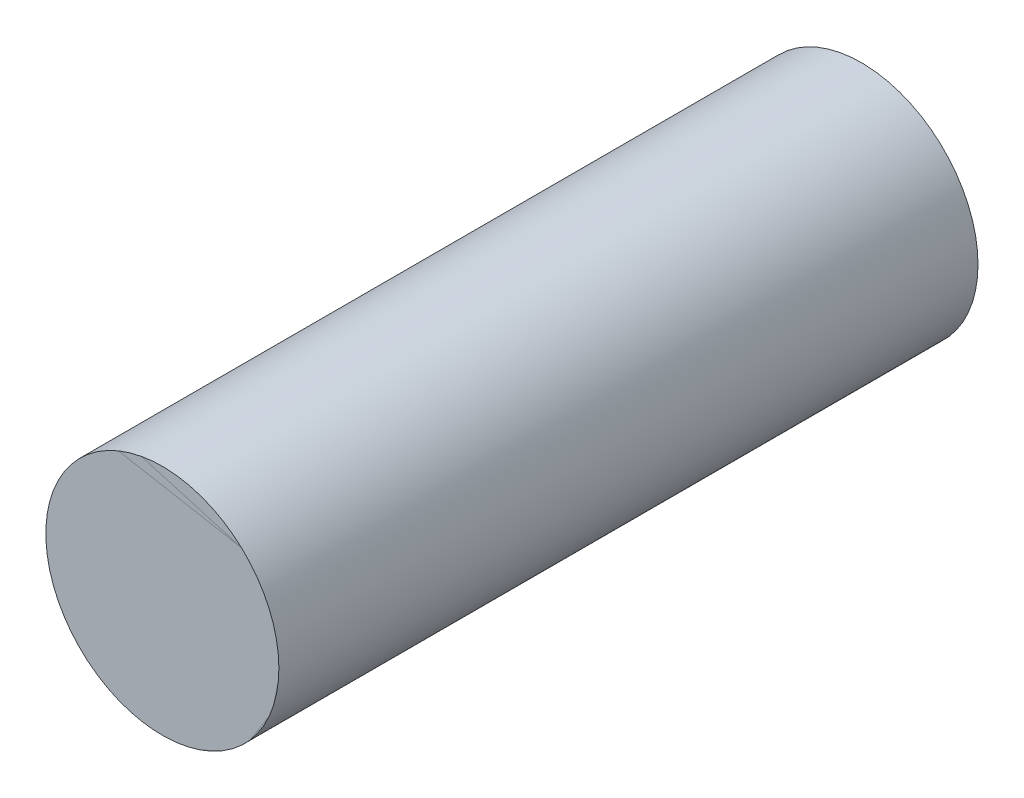
ISO-10303-21;
HEADER;
FILE_DESCRIPTION(('STEP AP214'),'2;1');
FILE_NAME('part.step','',(''),(''),'','','');
FILE_SCHEMA(('AUTOMOTIVE_DESIGN { 1 0 10303 214 1 1 1 1 }'));
ENDSEC;
DATA;
#1=APPLICATION_CONTEXT('core data for automotive mechanical design processes');
#2=APPLICATION_PROTOCOL_DEFINITION('international standard','automotive_design',2000,#1);
#3=PRODUCT_CONTEXT('',#1,'mechanical');
#4=PRODUCT('Part','Part','',(#3));
#5=PRODUCT_RELATED_PRODUCT_CATEGORY('part','',(#4));
#6=PRODUCT_DEFINITION_FORMATION('','',#4);
#7=PRODUCT_DEFINITION_CONTEXT('part definition',#1,'design');
#8=PRODUCT_DEFINITION('design','',#6,#7);
#9=PRODUCT_DEFINITION_SHAPE('','',#8);
#10=(LENGTH_UNIT() NAMED_UNIT(*) SI_UNIT(.MILLI.,.METRE.));
#11=(NAMED_UNIT(*) PLANE_ANGLE_UNIT() SI_UNIT($,.RADIAN.));
#12=(NAMED_UNIT(*) SI_UNIT($,.STERADIAN.) SOLID_ANGLE_UNIT());
#13=UNCERTAINTY_MEASURE_WITH_UNIT(LENGTH_MEASURE(1.E-05),#10,'distance_accuracy_value','');
#14=(GEOMETRIC_REPRESENTATION_CONTEXT(3) GLOBAL_UNCERTAINTY_ASSIGNED_CONTEXT((#13)) GLOBAL_UNIT_ASSIGNED_CONTEXT((#10,
#11,#12)) REPRESENTATION_CONTEXT('',''));
#15=CARTESIAN_POINT('',(0.,0.,0.));
#16=DIRECTION('',(0.,0.,1.));
#17=DIRECTION('',(1.,0.,0.));
#18=AXIS2_PLACEMENT_3D('',#15,#16,#17);
#19=CARTESIAN_POINT('',(-127.923352159799,-36.0039777719793,-7.54999999999981));
#20=DIRECTION('',(0.,0.,1.));
#21=DIRECTION('',(1.,0.,0.));
#22=AXIS2_PLACEMENT_3D('',#19,#20,#21);
#23=CYLINDRICAL_SURFACE('',#22,0.299999999999984);
#24=CARTESIAN_POINT('',(-127.923352159799,-36.0039777719793,-7.54999999999981));
#25=DIRECTION('',(0.,0.,1.));
#26=DIRECTION('',(1.,0.,0.));
#27=AXIS2_PLACEMENT_3D('',#24,#25,#26);
#28=CIRCLE('',#27,0.299999999999984);
#29=CARTESIAN_POINT('',(-127.623352159799,-36.0039777719793,-7.54999999999981));
#30=VERTEX_POINT('',#29);
#31=EDGE_CURVE('E11',#30,#30,#28,.T.);
#32=ORIENTED_EDGE('',*,*,#31,.T.);
#33=EDGE_LOOP('',(#32));
#34=FACE_BOUND('',#33,.T.);
#35=CARTESIAN_POINT('',(-127.923352159799,-36.0039777719793,-5.74999999999981));
#36=DIRECTION('',(0.,0.,1.));
#37=DIRECTION('',(1.,0.,0.));
#38=AXIS2_PLACEMENT_3D('',#35,#36,#37);
#39=CIRCLE('',#38,0.299999999999984);
#40=CARTESIAN_POINT('',(-127.623352159799,-36.0039777719793,-5.74999999999981));
#41=VERTEX_POINT('',#40);
#42=EDGE_CURVE('E46',#41,#41,#39,.T.);
#43=ORIENTED_EDGE('',*,*,#42,.F.);
#44=EDGE_LOOP('',(#43));
#45=FACE_BOUND('',#44,.T.);
#46=ADVANCED_FACE('F43',(#34,#45),#23,.T.);
#47=CARTESIAN_POINT('',(-127.923352159799,-36.0039777719793,-7.54999999999981));
#48=DIRECTION('',(0.,0.,1.));
#49=DIRECTION('',(1.,0.,0.));
#50=AXIS2_PLACEMENT_3D('',#47,#48,#49);
#51=PLANE('',#50);
#52=ORIENTED_EDGE('',*,*,#31,.F.);
#53=EDGE_LOOP('',(#52));
#54=FACE_BOUND('',#53,.T.);
#55=ADVANCED_FACE('F58',(#54),#51,.F.);
#56=CARTESIAN_POINT('',(-127.923352159799,-36.0039777719793,-5.74999999999981));
#57=DIRECTION('',(0.,0.,1.));
#58=DIRECTION('',(1.,0.,0.));
#59=AXIS2_PLACEMENT_3D('',#56,#57,#58);
#60=PLANE('',#59);
#61=ORIENTED_EDGE('',*,*,#42,.T.);
#62=EDGE_LOOP('',(#61));
#63=FACE_BOUND('',#62,.T.);
#64=ADVANCED_FACE('F55',(#63),#60,.T.);
#65=CLOSED_SHELL('',(#46,#55,#64));
#66=MANIFOLD_SOLID_BREP('B2',#65);
#67=CARTESIAN_POINT('',(-127.923352159799,-36.0039777719793,-5.74999999999981));
#68=DIRECTION('',(0.,0.,1.));
#69=DIRECTION('',(1.,0.,0.));
#70=AXIS2_PLACEMENT_3D('',#67,#68,#69);
#71=PLANE('',#70);
#72=CARTESIAN_POINT('',(-127.923352159799,-36.0039777719793,-5.74999999999981));
#73=DIRECTION('',(0.,0.,1.));
#74=DIRECTION('',(1.,0.,0.));
#75=AXIS2_PLACEMENT_3D('',#72,#73,#74);
#76=CIRCLE('',#75,0.299999999999995);
#77=CARTESIAN_POINT('',(-127.623352159799,-36.0039777719793,-5.74999999999981));
#78=VERTEX_POINT('',#77);
#79=EDGE_CURVE('E42',#78,#78,#76,.F.);
#80=ORIENTED_EDGE('',*,*,#79,.F.);
#81=EDGE_LOOP('',(#80));
#82=FACE_BOUND('',#81,.T.);
#83=ADVANCED_FACE('F83',(#82),#71,.T.);
#84=OPEN_SHELL('',(#83));
#85=SHELL_BASED_SURFACE_MODEL('B6',(#84));
#86=ADVANCED_BREP_SHAPE_REPRESENTATION('',(#18,#66),#14);
#87=MANIFOLD_SURFACE_SHAPE_REPRESENTATION('',(#18,#85),#14);
#88=SHAPE_REPRESENTATION('',(#18),#14);
#89=SHAPE_DEFINITION_REPRESENTATION(#9,#88);
#90=SHAPE_REPRESENTATION_RELATIONSHIP('','',#88,#86);
#91=SHAPE_REPRESENTATION_RELATIONSHIP('','',#88,#87);
ENDSEC;
END-ISO-10303-21;
